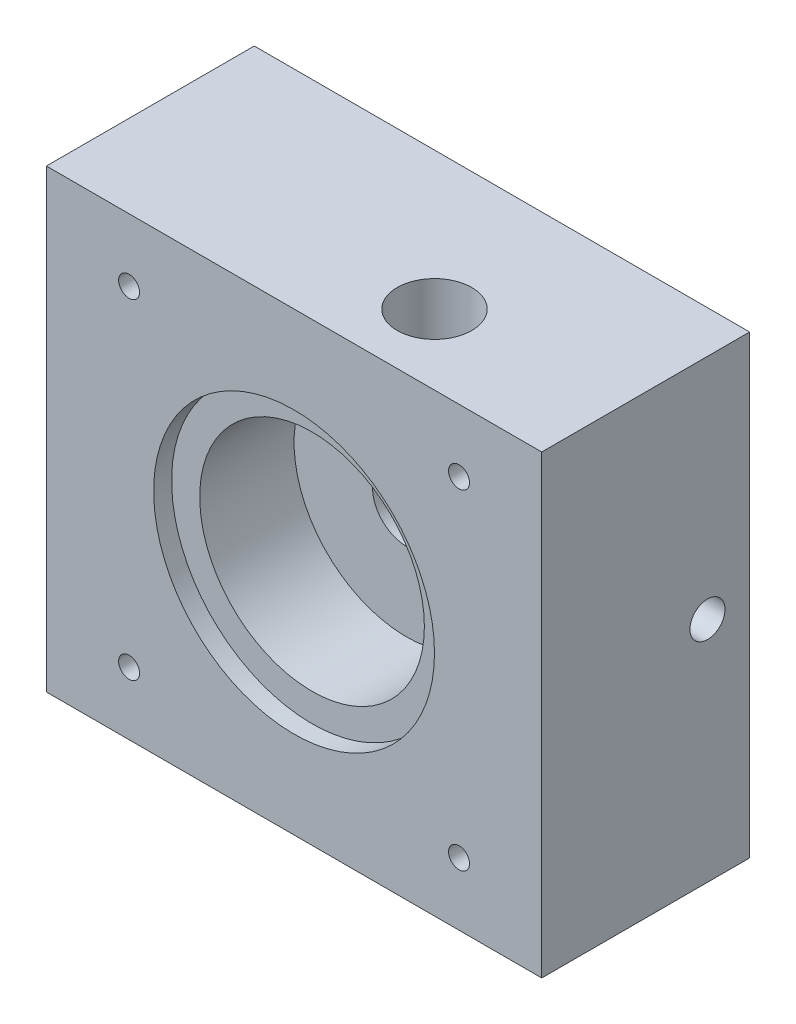
ISO-10303-21;
HEADER;
FILE_DESCRIPTION(('STEP AP214'),'2;1');
FILE_NAME('part.step','',(''),(''),'','','');
FILE_SCHEMA(('AUTOMOTIVE_DESIGN { 1 0 10303 214 1 1 1 1 }'));
ENDSEC;
DATA;
#1=APPLICATION_CONTEXT('core data for automotive mechanical design processes');
#2=APPLICATION_PROTOCOL_DEFINITION('international standard','automotive_design',2000,#1);
#3=PRODUCT_CONTEXT('',#1,'mechanical');
#4=PRODUCT('Part','Part','',(#3));
#5=PRODUCT_RELATED_PRODUCT_CATEGORY('part','',(#4));
#6=PRODUCT_DEFINITION_FORMATION('','',#4);
#7=PRODUCT_DEFINITION_CONTEXT('part definition',#1,'design');
#8=PRODUCT_DEFINITION('design','',#6,#7);
#9=PRODUCT_DEFINITION_SHAPE('','',#8);
#10=(LENGTH_UNIT() NAMED_UNIT(*) SI_UNIT(.MILLI.,.METRE.));
#11=(NAMED_UNIT(*) PLANE_ANGLE_UNIT() SI_UNIT($,.RADIAN.));
#12=(NAMED_UNIT(*) SI_UNIT($,.STERADIAN.) SOLID_ANGLE_UNIT());
#13=UNCERTAINTY_MEASURE_WITH_UNIT(LENGTH_MEASURE(1.E-05),#10,'distance_accuracy_value','');
#14=(GEOMETRIC_REPRESENTATION_CONTEXT(3) GLOBAL_UNCERTAINTY_ASSIGNED_CONTEXT((#13)) GLOBAL_UNIT_ASSIGNED_CONTEXT((#10,
#11,#12)) REPRESENTATION_CONTEXT('',''));
#15=CARTESIAN_POINT('',(0.,0.,0.));
#16=DIRECTION('',(0.,0.,1.));
#17=DIRECTION('',(1.,0.,0.));
#18=AXIS2_PLACEMENT_3D('',#15,#16,#17);
#19=CARTESIAN_POINT('',(-18.475,0.,6.35));
#20=DIRECTION('',(0.,0.,-1.));
#21=DIRECTION('',(-1.,0.,0.));
#22=AXIS2_PLACEMENT_3D('',#19,#20,#21);
#23=CYLINDRICAL_SURFACE('',#22,1.984375);
#24=CARTESIAN_POINT('',(-18.475,0.,0.));
#25=DIRECTION('',(0.,0.,1.));
#26=DIRECTION('',(1.,0.,0.));
#27=AXIS2_PLACEMENT_3D('',#24,#25,#26);
#28=CIRCLE('',#27,1.984375);
#29=CARTESIAN_POINT('',(-16.490625,0.,0.));
#30=VERTEX_POINT('',#29);
#31=EDGE_CURVE('E193',#30,#30,#28,.T.);
#32=ORIENTED_EDGE('',*,*,#31,.F.);
#33=EDGE_LOOP('',(#32));
#34=FACE_BOUND('',#33,.T.);
#35=DIRECTION('',(0.,0.,-1.));
#36=VECTOR('',#35,1.);
#37=CARTESIAN_POINT('',(-16.8875,1.190625,6.35));
#38=LINE('',#37,#36);
#39=CARTESIAN_POINT('',(-16.8875,1.190625,6.35));
#40=VERTEX_POINT('',#39);
#41=CARTESIAN_POINT('',(-16.8875,1.190625,3.175));
#42=VERTEX_POINT('',#41);
#43=EDGE_CURVE('E68',#40,#42,#38,.T.);
#44=ORIENTED_EDGE('',*,*,#43,.T.);
#45=CARTESIAN_POINT('',(-18.475,0.,4.7625));
#46=DIRECTION('',(-0.707106781186547,0.,-0.707106781186547));
#47=DIRECTION('',(0.707106781186547,0.,-0.707106781186547));
#48=AXIS2_PLACEMENT_3D('',#45,#46,#47);
#49=ELLIPSE('',#48,2.80633003783411,1.984375);
#50=CARTESIAN_POINT('',(-18.475,1.984375,4.7625));
#51=VERTEX_POINT('',#50);
#52=EDGE_CURVE('E136',#42,#51,#49,.F.);
#53=ORIENTED_EDGE('',*,*,#52,.T.);
#54=CARTESIAN_POINT('',(-18.475,0.,4.7625));
#55=DIRECTION('',(0.707106781186547,0.,-0.707106781186547));
#56=DIRECTION('',(-0.707106781186547,0.,-0.707106781186547));
#57=AXIS2_PLACEMENT_3D('',#54,#55,#56);
#58=ELLIPSE('',#57,2.80633003783411,1.984375);
#59=CARTESIAN_POINT('',(-18.475,-1.984375,4.7625));
#60=VERTEX_POINT('',#59);
#61=EDGE_CURVE('E164',#51,#60,#58,.F.);
#62=ORIENTED_EDGE('',*,*,#61,.T.);
#63=CARTESIAN_POINT('',(-16.8875,-1.190625,3.175));
#64=VERTEX_POINT('',#63);
#65=EDGE_CURVE('E148',#60,#64,#49,.F.);
#66=ORIENTED_EDGE('',*,*,#65,.T.);
#67=DIRECTION('',(0.,0.,-1.));
#68=VECTOR('',#67,1.);
#69=CARTESIAN_POINT('',(-16.8875,-1.190625,6.35));
#70=LINE('',#69,#68);
#71=CARTESIAN_POINT('',(-16.8875,-1.190625,6.35));
#72=VERTEX_POINT('',#71);
#73=EDGE_CURVE('E150',#64,#72,#70,.F.);
#74=ORIENTED_EDGE('',*,*,#73,.T.);
#75=CARTESIAN_POINT('',(-18.475,0.,6.35));
#76=DIRECTION('',(0.,0.,1.));
#77=DIRECTION('',(1.,0.,0.));
#78=AXIS2_PLACEMENT_3D('',#75,#76,#77);
#79=CIRCLE('',#78,1.984375);
#80=EDGE_CURVE('E156',#72,#40,#79,.T.);
#81=ORIENTED_EDGE('',*,*,#80,.T.);
#82=EDGE_LOOP('',(#44,#53,#62,#66,#74,#81));
#83=FACE_BOUND('',#82,.T.);
#84=ADVANCED_FACE('F46',(#34,#83),#23,.F.);
#85=CARTESIAN_POINT('',(-18.475,0.,6.35));
#86=DIRECTION('',(0.,0.,-1.));
#87=DIRECTION('',(1.,0.,0.));
#88=AXIS2_PLACEMENT_3D('',#85,#86,#87);
#89=PLANE('',#88);
#90=ORIENTED_EDGE('',*,*,#80,.F.);
#91=DIRECTION('',(0.,1.,0.));
#92=VECTOR('',#91,1.);
#93=CARTESIAN_POINT('',(-16.8875,0.,6.35));
#94=LINE('',#93,#92);
#95=EDGE_CURVE('E341',#72,#40,#94,.T.);
#96=ORIENTED_EDGE('',*,*,#95,.T.);
#97=EDGE_LOOP('',(#90,#96));
#98=FACE_BOUND('',#97,.T.);
#99=ADVANCED_FACE('F311',(#98),#89,.T.);
#100=CARTESIAN_POINT('',(18.475,0.,6.35));
#101=DIRECTION('',(0.,0.,-1.));
#102=DIRECTION('',(-1.,0.,0.));
#103=AXIS2_PLACEMENT_3D('',#100,#101,#102);
#104=CYLINDRICAL_SURFACE('',#103,1.984375);
#105=CARTESIAN_POINT('',(18.475,0.,0.));
#106=DIRECTION('',(0.,0.,-1.));
#107=DIRECTION('',(-1.,0.,0.));
#108=AXIS2_PLACEMENT_3D('',#105,#106,#107);
#109=CIRCLE('',#108,1.984375);
#110=CARTESIAN_POINT('',(16.490625,0.,0.));
#111=VERTEX_POINT('',#110);
#112=EDGE_CURVE('E197',#111,#111,#109,.T.);
#113=ORIENTED_EDGE('',*,*,#112,.T.);
#114=EDGE_LOOP('',(#113));
#115=FACE_BOUND('',#114,.T.);
#116=DIRECTION('',(0.,0.,-1.));
#117=VECTOR('',#116,1.);
#118=CARTESIAN_POINT('',(16.8875,-1.190625,6.35));
#119=LINE('',#118,#117);
#120=CARTESIAN_POINT('',(16.8875,-1.190625,3.175));
#121=VERTEX_POINT('',#120);
#122=CARTESIAN_POINT('',(16.8875,-1.190625,6.35));
#123=VERTEX_POINT('',#122);
#124=EDGE_CURVE('E176',#121,#123,#119,.F.);
#125=ORIENTED_EDGE('',*,*,#124,.F.);
#126=CARTESIAN_POINT('',(18.475,0.,4.7625));
#127=DIRECTION('',(0.707106781186547,0.,-0.707106781186547));
#128=DIRECTION('',(-0.707106781186547,0.,-0.707106781186547));
#129=AXIS2_PLACEMENT_3D('',#126,#127,#128);
#130=ELLIPSE('',#129,2.80633003783411,1.984375);
#131=CARTESIAN_POINT('',(18.475,-1.984375,4.7625));
#132=VERTEX_POINT('',#131);
#133=EDGE_CURVE('E185',#121,#132,#130,.F.);
#134=ORIENTED_EDGE('',*,*,#133,.T.);
#135=CARTESIAN_POINT('',(18.475,0.,4.7625));
#136=DIRECTION('',(-0.707106781186547,0.,-0.707106781186547));
#137=DIRECTION('',(0.707106781186547,0.,-0.707106781186547));
#138=AXIS2_PLACEMENT_3D('',#135,#136,#137);
#139=ELLIPSE('',#138,2.80633003783411,1.984375);
#140=CARTESIAN_POINT('',(18.475,1.984375,4.7625));
#141=VERTEX_POINT('',#140);
#142=EDGE_CURVE('E190',#132,#141,#139,.F.);
#143=ORIENTED_EDGE('',*,*,#142,.T.);
#144=CARTESIAN_POINT('',(16.8875,1.190625,3.175));
#145=VERTEX_POINT('',#144);
#146=EDGE_CURVE('E189',#141,#145,#130,.F.);
#147=ORIENTED_EDGE('',*,*,#146,.T.);
#148=DIRECTION('',(0.,0.,-1.));
#149=VECTOR('',#148,1.);
#150=CARTESIAN_POINT('',(16.8875,1.190625,6.35));
#151=LINE('',#150,#149);
#152=CARTESIAN_POINT('',(16.8875,1.190625,6.35));
#153=VERTEX_POINT('',#152);
#154=EDGE_CURVE('E170',#153,#145,#151,.T.);
#155=ORIENTED_EDGE('',*,*,#154,.F.);
#156=CARTESIAN_POINT('',(18.475,0.,6.35));
#157=DIRECTION('',(0.,0.,-1.));
#158=DIRECTION('',(-1.,0.,0.));
#159=AXIS2_PLACEMENT_3D('',#156,#157,#158);
#160=CIRCLE('',#159,1.984375);
#161=EDGE_CURVE('E206',#123,#153,#160,.T.);
#162=ORIENTED_EDGE('',*,*,#161,.F.);
#163=EDGE_LOOP('',(#125,#134,#143,#147,#155,#162));
#164=FACE_BOUND('',#163,.T.);
#165=ADVANCED_FACE('F319',(#115,#164),#104,.F.);
#166=CARTESIAN_POINT('',(18.475,0.,6.35));
#167=DIRECTION('',(0.,0.,-1.));
#168=DIRECTION('',(-1.,0.,0.));
#169=AXIS2_PLACEMENT_3D('',#166,#167,#168);
#170=PLANE('',#169);
#171=ORIENTED_EDGE('',*,*,#161,.T.);
#172=DIRECTION('',(0.,-1.,0.));
#173=VECTOR('',#172,1.);
#174=CARTESIAN_POINT('',(16.8875,0.,6.35));
#175=LINE('',#174,#173);
#176=EDGE_CURVE('E264',#153,#123,#175,.T.);
#177=ORIENTED_EDGE('',*,*,#176,.T.);
#178=EDGE_LOOP('',(#171,#177));
#179=FACE_BOUND('',#178,.T.);
#180=ADVANCED_FACE('F299',(#179),#170,.T.);
#181=CARTESIAN_POINT('',(0.,0.,0.));
#182=DIRECTION('',(0.,0.,1.));
#183=DIRECTION('',(1.,0.,0.));
#184=AXIS2_PLACEMENT_3D('',#181,#182,#183);
#185=CYLINDRICAL_SURFACE('',#184,3.8354);
#186=CARTESIAN_POINT('',(0.,0.,10.8));
#187=DIRECTION('',(0.,0.,1.));
#188=DIRECTION('',(1.,0.,0.));
#189=AXIS2_PLACEMENT_3D('',#186,#187,#188);
#190=CIRCLE('',#189,3.8354);
#191=CARTESIAN_POINT('',(3.8354,0.,10.8));
#192=VERTEX_POINT('',#191);
#193=EDGE_CURVE('E219',#192,#192,#190,.T.);
#194=ORIENTED_EDGE('',*,*,#193,.T.);
#195=EDGE_LOOP('',(#194));
#196=FACE_BOUND('',#195,.T.);
#197=CARTESIAN_POINT('',(0.,0.,2.794));
#198=DIRECTION('',(0.,0.,-1.));
#199=DIRECTION('',(-1.,0.,0.));
#200=AXIS2_PLACEMENT_3D('',#197,#198,#199);
#201=CIRCLE('',#200,3.8354);
#202=CARTESIAN_POINT('',(-3.8354,0.,2.794));
#203=VERTEX_POINT('',#202);
#204=EDGE_CURVE('E215',#203,#203,#201,.F.);
#205=ORIENTED_EDGE('',*,*,#204,.F.);
#206=EDGE_LOOP('',(#205));
#207=FACE_BOUND('',#206,.T.);
#208=ADVANCED_FACE('F297',(#196,#207),#185,.F.);
#209=CARTESIAN_POINT('',(28.,-25.75,23.5));
#210=DIRECTION('',(-1.,0.,0.));
#211=DIRECTION('',(0.,0.,1.));
#212=AXIS2_PLACEMENT_3D('',#209,#210,#211);
#213=PLANE('',#212);
#214=CARTESIAN_POINT('',(28.,0.,4.7625));
#215=DIRECTION('',(1.,0.,0.));
#216=DIRECTION('',(0.,0.,-1.));
#217=AXIS2_PLACEMENT_3D('',#214,#215,#216);
#218=CIRCLE('',#217,1.984375);
#219=CARTESIAN_POINT('',(28.,0.,2.778125));
#220=VERTEX_POINT('',#219);
#221=EDGE_CURVE('E166',#220,#220,#218,.T.);
#222=ORIENTED_EDGE('',*,*,#221,.F.);
#223=EDGE_LOOP('',(#222));
#224=FACE_BOUND('',#223,.T.);
#225=DIRECTION('',(0.,1.,0.));
#226=VECTOR('',#225,1.);
#227=CARTESIAN_POINT('',(28.,-25.75,0.));
#228=LINE('',#227,#226);
#229=CARTESIAN_POINT('',(28.,-25.75,0.));
#230=VERTEX_POINT('',#229);
#231=CARTESIAN_POINT('',(28.,25.75,0.));
#232=VERTEX_POINT('',#231);
#233=EDGE_CURVE('E232',#230,#232,#228,.T.);
#234=ORIENTED_EDGE('',*,*,#233,.T.);
#235=DIRECTION('',(0.,0.,-1.));
#236=VECTOR('',#235,1.);
#237=CARTESIAN_POINT('',(28.,25.75,23.5));
#238=LINE('',#237,#236);
#239=CARTESIAN_POINT('',(28.,25.75,23.5));
#240=VERTEX_POINT('',#239);
#241=EDGE_CURVE('E261',#240,#232,#238,.T.);
#242=ORIENTED_EDGE('',*,*,#241,.F.);
#243=DIRECTION('',(0.,1.,0.));
#244=VECTOR('',#243,1.);
#245=CARTESIAN_POINT('',(28.,-25.75,23.5));
#246=LINE('',#245,#244);
#247=CARTESIAN_POINT('',(28.,-25.75,23.5));
#248=VERTEX_POINT('',#247);
#249=EDGE_CURVE('E235',#248,#240,#246,.T.);
#250=ORIENTED_EDGE('',*,*,#249,.F.);
#251=DIRECTION('',(0.,0.,-1.));
#252=VECTOR('',#251,1.);
#253=CARTESIAN_POINT('',(28.,-25.75,23.5));
#254=LINE('',#253,#252);
#255=EDGE_CURVE('E245',#248,#230,#254,.T.);
#256=ORIENTED_EDGE('',*,*,#255,.T.);
#257=EDGE_LOOP('',(#234,#242,#250,#256));
#258=FACE_BOUND('',#257,.T.);
#259=ADVANCED_FACE('F48',(#224,#258),#213,.F.);
#260=CARTESIAN_POINT('',(28.,25.75,23.5));
#261=DIRECTION('',(0.,-1.,0.));
#262=DIRECTION('',(0.,0.,-1.));
#263=AXIS2_PLACEMENT_3D('',#260,#261,#262);
#264=PLANE('',#263);
#265=CARTESIAN_POINT('',(7.9375,25.75,15.5625));
#266=DIRECTION('',(0.,1.,0.));
#267=DIRECTION('',(0.,0.,1.));
#268=AXIS2_PLACEMENT_3D('',#265,#266,#267);
#269=CIRCLE('',#268,4.2164);
#270=CARTESIAN_POINT('',(7.9375,25.75,19.7789));
#271=VERTEX_POINT('',#270);
#272=EDGE_CURVE('E204',#271,#271,#269,.T.);
#273=ORIENTED_EDGE('',*,*,#272,.F.);
#274=EDGE_LOOP('',(#273));
#275=FACE_BOUND('',#274,.T.);
#276=DIRECTION('',(-1.,0.,0.));
#277=VECTOR('',#276,1.);
#278=CARTESIAN_POINT('',(28.,25.75,0.));
#279=LINE('',#278,#277);
#280=CARTESIAN_POINT('',(-28.,25.75,0.));
#281=VERTEX_POINT('',#280);
#282=EDGE_CURVE('E248',#232,#281,#279,.T.);
#283=ORIENTED_EDGE('',*,*,#282,.T.);
#284=DIRECTION('',(0.,0.,-1.));
#285=VECTOR('',#284,1.);
#286=CARTESIAN_POINT('',(-28.,25.75,23.5));
#287=LINE('',#286,#285);
#288=CARTESIAN_POINT('',(-28.,25.75,23.5));
#289=VERTEX_POINT('',#288);
#290=EDGE_CURVE('E258',#289,#281,#287,.T.);
#291=ORIENTED_EDGE('',*,*,#290,.F.);
#292=DIRECTION('',(-1.,0.,0.));
#293=VECTOR('',#292,1.);
#294=CARTESIAN_POINT('',(28.,25.75,23.5));
#295=LINE('',#294,#293);
#296=EDGE_CURVE('E238',#240,#289,#295,.T.);
#297=ORIENTED_EDGE('',*,*,#296,.F.);
#298=ORIENTED_EDGE('',*,*,#241,.T.);
#299=EDGE_LOOP('',(#283,#291,#297,#298));
#300=FACE_BOUND('',#299,.T.);
#301=ADVANCED_FACE('F421',(#275,#300),#264,.F.);
#302=CARTESIAN_POINT('',(-28.,25.75,23.5));
#303=DIRECTION('',(1.,0.,0.));
#304=DIRECTION('',(0.,0.,-1.));
#305=AXIS2_PLACEMENT_3D('',#302,#303,#304);
#306=PLANE('',#305);
#307=CARTESIAN_POINT('',(-28.,0.,4.7625));
#308=DIRECTION('',(1.,0.,0.));
#309=DIRECTION('',(0.,0.,-1.));
#310=AXIS2_PLACEMENT_3D('',#307,#308,#309);
#311=CIRCLE('',#310,1.984375);
#312=CARTESIAN_POINT('',(-28.,0.,2.778125));
#313=VERTEX_POINT('',#312);
#314=EDGE_CURVE('E725',#313,#313,#311,.T.);
#315=ORIENTED_EDGE('',*,*,#314,.T.);
#316=EDGE_LOOP('',(#315));
#317=FACE_BOUND('',#316,.T.);
#318=DIRECTION('',(0.,-1.,0.));
#319=VECTOR('',#318,1.);
#320=CARTESIAN_POINT('',(-28.,25.75,0.));
#321=LINE('',#320,#319);
#322=CARTESIAN_POINT('',(-28.,-25.75,0.));
#323=VERTEX_POINT('',#322);
#324=EDGE_CURVE('E250',#281,#323,#321,.T.);
#325=ORIENTED_EDGE('',*,*,#324,.T.);
#326=DIRECTION('',(0.,0.,-1.));
#327=VECTOR('',#326,1.);
#328=CARTESIAN_POINT('',(-28.,-25.75,23.5));
#329=LINE('',#328,#327);
#330=CARTESIAN_POINT('',(-28.,-25.75,23.5));
#331=VERTEX_POINT('',#330);
#332=EDGE_CURVE('E255',#331,#323,#329,.T.);
#333=ORIENTED_EDGE('',*,*,#332,.F.);
#334=DIRECTION('',(0.,-1.,0.));
#335=VECTOR('',#334,1.);
#336=CARTESIAN_POINT('',(-28.,25.75,23.5));
#337=LINE('',#336,#335);
#338=EDGE_CURVE('E241',#289,#331,#337,.T.);
#339=ORIENTED_EDGE('',*,*,#338,.F.);
#340=ORIENTED_EDGE('',*,*,#290,.T.);
#341=EDGE_LOOP('',(#325,#333,#339,#340));
#342=FACE_BOUND('',#341,.T.);
#343=ADVANCED_FACE('F440',(#317,#342),#306,.F.);
#344=CARTESIAN_POINT('',(-28.,-25.75,23.5));
#345=DIRECTION('',(0.,1.,0.));
#346=DIRECTION('',(0.,0.,1.));
#347=AXIS2_PLACEMENT_3D('',#344,#345,#346);
#348=PLANE('',#347);
#349=DIRECTION('',(1.,0.,0.));
#350=VECTOR('',#349,1.);
#351=CARTESIAN_POINT('',(-28.,-25.75,0.));
#352=LINE('',#351,#350);
#353=EDGE_CURVE('E239',#323,#230,#352,.T.);
#354=ORIENTED_EDGE('',*,*,#353,.T.);
#355=ORIENTED_EDGE('',*,*,#255,.F.);
#356=DIRECTION('',(1.,0.,0.));
#357=VECTOR('',#356,1.);
#358=CARTESIAN_POINT('',(-28.,-25.75,23.5));
#359=LINE('',#358,#357);
#360=EDGE_CURVE('E243',#331,#248,#359,.T.);
#361=ORIENTED_EDGE('',*,*,#360,.F.);
#362=ORIENTED_EDGE('',*,*,#332,.T.);
#363=EDGE_LOOP('',(#354,#355,#361,#362));
#364=FACE_BOUND('',#363,.T.);
#365=ADVANCED_FACE('F438',(#364),#348,.F.);
#366=CARTESIAN_POINT('',(0.,0.,23.5));
#367=DIRECTION('',(0.,0.,1.));
#368=DIRECTION('',(1.,0.,0.));
#369=AXIS2_PLACEMENT_3D('',#366,#367,#368);
#370=PLANE('',#369);
#371=CARTESIAN_POINT('',(-18.65,18.65,23.5));
#372=DIRECTION('',(0.,0.,-1.));
#373=DIRECTION('',(-1.,0.,0.));
#374=AXIS2_PLACEMENT_3D('',#371,#372,#373);
#375=CIRCLE('',#374,1.1811);
#376=CARTESIAN_POINT('',(-19.8311,18.65,23.5));
#377=VERTEX_POINT('',#376);
#378=EDGE_CURVE('E705',#377,#377,#375,.T.);
#379=ORIENTED_EDGE('',*,*,#378,.T.);
#380=EDGE_LOOP('',(#379));
#381=FACE_BOUND('',#380,.T.);
#382=CARTESIAN_POINT('',(-18.65,-18.65,23.5));
#383=DIRECTION('',(0.,0.,1.));
#384=DIRECTION('',(-1.,0.,0.));
#385=AXIS2_PLACEMENT_3D('',#382,#383,#384);
#386=CIRCLE('',#385,1.1811);
#387=CARTESIAN_POINT('',(-19.8311,-18.65,23.5));
#388=VERTEX_POINT('',#387);
#389=EDGE_CURVE('E707',#388,#388,#386,.T.);
#390=ORIENTED_EDGE('',*,*,#389,.F.);
#391=EDGE_LOOP('',(#390));
#392=FACE_BOUND('',#391,.T.);
#393=CARTESIAN_POINT('',(18.65,-18.65,23.5));
#394=DIRECTION('',(0.,0.,-1.));
#395=DIRECTION('',(1.,0.,0.));
#396=AXIS2_PLACEMENT_3D('',#393,#394,#395);
#397=CIRCLE('',#396,1.1811);
#398=CARTESIAN_POINT('',(19.8311,-18.65,23.5));
#399=VERTEX_POINT('',#398);
#400=EDGE_CURVE('E713',#399,#399,#397,.T.);
#401=ORIENTED_EDGE('',*,*,#400,.T.);
#402=EDGE_LOOP('',(#401));
#403=FACE_BOUND('',#402,.T.);
#404=CARTESIAN_POINT('',(18.65,18.65,23.5));
#405=DIRECTION('',(0.,0.,1.));
#406=DIRECTION('',(1.,0.,0.));
#407=AXIS2_PLACEMENT_3D('',#404,#405,#406);
#408=CIRCLE('',#407,1.1811);
#409=CARTESIAN_POINT('',(19.8311,18.65,23.5));
#410=VERTEX_POINT('',#409);
#411=EDGE_CURVE('E719',#410,#410,#408,.T.);
#412=ORIENTED_EDGE('',*,*,#411,.F.);
#413=EDGE_LOOP('',(#412));
#414=FACE_BOUND('',#413,.T.);
#415=CARTESIAN_POINT('',(0.,0.,23.5));
#416=DIRECTION('',(0.,0.,1.));
#417=DIRECTION('',(1.,0.,0.));
#418=AXIS2_PLACEMENT_3D('',#415,#416,#417);
#419=CIRCLE('',#418,15.875);
#420=CARTESIAN_POINT('',(15.875,0.,23.5));
#421=VERTEX_POINT('',#420);
#422=EDGE_CURVE('E226',#421,#421,#419,.T.);
#423=ORIENTED_EDGE('',*,*,#422,.F.);
#424=EDGE_LOOP('',(#423));
#425=FACE_BOUND('',#424,.T.);
#426=ORIENTED_EDGE('',*,*,#249,.T.);
#427=ORIENTED_EDGE('',*,*,#296,.T.);
#428=ORIENTED_EDGE('',*,*,#338,.T.);
#429=ORIENTED_EDGE('',*,*,#360,.T.);
#430=EDGE_LOOP('',(#426,#427,#428,#429));
#431=FACE_BOUND('',#430,.T.);
#432=ADVANCED_FACE('F434',(#381,#392,#403,#414,#425,#431),#370,.T.);
#433=CARTESIAN_POINT('',(0.,0.,0.));
#434=DIRECTION('',(0.,0.,1.));
#435=DIRECTION('',(1.,0.,0.));
#436=AXIS2_PLACEMENT_3D('',#433,#434,#435);
#437=PLANE('',#436);
#438=CARTESIAN_POINT('',(-18.65,18.65,0.));
#439=DIRECTION('',(0.,0.,-1.));
#440=DIRECTION('',(-1.,0.,0.));
#441=AXIS2_PLACEMENT_3D('',#438,#439,#440);
#442=CIRCLE('',#441,1.1811);
#443=CARTESIAN_POINT('',(-19.8311,18.65,0.));
#444=VERTEX_POINT('',#443);
#445=EDGE_CURVE('E702',#444,#444,#442,.T.);
#446=ORIENTED_EDGE('',*,*,#445,.F.);
#447=EDGE_LOOP('',(#446));
#448=FACE_BOUND('',#447,.T.);
#449=CARTESIAN_POINT('',(-18.65,-18.65,0.));
#450=DIRECTION('',(0.,0.,1.));
#451=DIRECTION('',(-1.,0.,0.));
#452=AXIS2_PLACEMENT_3D('',#449,#450,#451);
#453=CIRCLE('',#452,1.1811);
#454=CARTESIAN_POINT('',(-19.8311,-18.65,0.));
#455=VERTEX_POINT('',#454);
#456=EDGE_CURVE('E710',#455,#455,#453,.T.);
#457=ORIENTED_EDGE('',*,*,#456,.T.);
#458=EDGE_LOOP('',(#457));
#459=FACE_BOUND('',#458,.T.);
#460=CARTESIAN_POINT('',(18.65,-18.65,0.));
#461=DIRECTION('',(0.,0.,-1.));
#462=DIRECTION('',(1.,0.,0.));
#463=AXIS2_PLACEMENT_3D('',#460,#461,#462);
#464=CIRCLE('',#463,1.1811);
#465=CARTESIAN_POINT('',(19.8311,-18.65,0.));
#466=VERTEX_POINT('',#465);
#467=EDGE_CURVE('E716',#466,#466,#464,.T.);
#468=ORIENTED_EDGE('',*,*,#467,.F.);
#469=EDGE_LOOP('',(#468));
#470=FACE_BOUND('',#469,.T.);
#471=CARTESIAN_POINT('',(18.65,18.65,0.));
#472=DIRECTION('',(0.,0.,1.));
#473=DIRECTION('',(1.,0.,0.));
#474=AXIS2_PLACEMENT_3D('',#471,#472,#473);
#475=CIRCLE('',#474,1.1811);
#476=CARTESIAN_POINT('',(19.8311,18.65,0.));
#477=VERTEX_POINT('',#476);
#478=EDGE_CURVE('E722',#477,#477,#475,.T.);
#479=ORIENTED_EDGE('',*,*,#478,.T.);
#480=EDGE_LOOP('',(#479));
#481=FACE_BOUND('',#480,.T.);
#482=ORIENTED_EDGE('',*,*,#31,.T.);
#483=EDGE_LOOP('',(#482));
#484=FACE_BOUND('',#483,.T.);
#485=ORIENTED_EDGE('',*,*,#112,.F.);
#486=EDGE_LOOP('',(#485));
#487=FACE_BOUND('',#486,.T.);
#488=CARTESIAN_POINT('',(0.,0.,0.));
#489=DIRECTION('',(0.,0.,-1.));
#490=DIRECTION('',(-1.,0.,0.));
#491=AXIS2_PLACEMENT_3D('',#488,#489,#490);
#492=CIRCLE('',#491,6.35);
#493=CARTESIAN_POINT('',(-6.35,0.,0.));
#494=VERTEX_POINT('',#493);
#495=EDGE_CURVE('E216',#494,#494,#492,.T.);
#496=ORIENTED_EDGE('',*,*,#495,.F.);
#497=EDGE_LOOP('',(#496));
#498=FACE_BOUND('',#497,.T.);
#499=ORIENTED_EDGE('',*,*,#233,.F.);
#500=ORIENTED_EDGE('',*,*,#353,.F.);
#501=ORIENTED_EDGE('',*,*,#324,.F.);
#502=ORIENTED_EDGE('',*,*,#282,.F.);
#503=EDGE_LOOP('',(#499,#500,#501,#502));
#504=FACE_BOUND('',#503,.T.);
#505=ADVANCED_FACE('F428',(#448,#459,#470,#481,#484,#487,#498,#504),#437,.F.);
#506=CARTESIAN_POINT('',(0.,0.,21.468));
#507=DIRECTION('',(0.,0.,1.));
#508=DIRECTION('',(1.,0.,0.));
#509=AXIS2_PLACEMENT_3D('',#506,#507,#508);
#510=CYLINDRICAL_SURFACE('',#509,15.875);
#511=CARTESIAN_POINT('',(0.,0.,21.468));
#512=DIRECTION('',(0.,0.,1.));
#513=DIRECTION('',(1.,0.,0.));
#514=AXIS2_PLACEMENT_3D('',#511,#512,#513);
#515=CIRCLE('',#514,15.875);
#516=CARTESIAN_POINT('',(15.875,0.,21.468));
#517=VERTEX_POINT('',#516);
#518=EDGE_CURVE('E229',#517,#517,#515,.T.);
#519=ORIENTED_EDGE('',*,*,#518,.F.);
#520=EDGE_LOOP('',(#519));
#521=FACE_BOUND('',#520,.T.);
#522=ORIENTED_EDGE('',*,*,#422,.T.);
#523=EDGE_LOOP('',(#522));
#524=FACE_BOUND('',#523,.T.);
#525=ADVANCED_FACE('F454',(#521,#524),#510,.F.);
#526=CARTESIAN_POINT('',(0.,0.,21.468));
#527=DIRECTION('',(0.,0.,1.));
#528=DIRECTION('',(1.,0.,0.));
#529=AXIS2_PLACEMENT_3D('',#526,#527,#528);
#530=PLANE('',#529);
#531=CARTESIAN_POINT('',(0.,0.,21.468));
#532=DIRECTION('',(0.,0.,1.));
#533=DIRECTION('',(1.,0.,0.));
#534=AXIS2_PLACEMENT_3D('',#531,#532,#533);
#535=CIRCLE('',#534,12.7);
#536=CARTESIAN_POINT('',(12.7,0.,21.468));
#537=VERTEX_POINT('',#536);
#538=EDGE_CURVE('E222',#537,#537,#535,.T.);
#539=ORIENTED_EDGE('',*,*,#538,.F.);
#540=EDGE_LOOP('',(#539));
#541=FACE_BOUND('',#540,.T.);
#542=ORIENTED_EDGE('',*,*,#518,.T.);
#543=EDGE_LOOP('',(#542));
#544=FACE_BOUND('',#543,.T.);
#545=ADVANCED_FACE('F306',(#541,#544),#530,.T.);
#546=CARTESIAN_POINT('',(0.,0.,10.8));
#547=DIRECTION('',(0.,0.,1.));
#548=DIRECTION('',(1.,0.,0.));
#549=AXIS2_PLACEMENT_3D('',#546,#547,#548);
#550=CYLINDRICAL_SURFACE('',#549,12.7);
#551=CARTESIAN_POINT('',(7.9375,9.91393432245746,19.7789));
#552=CARTESIAN_POINT('',(8.07662802927976,9.80254174511982,19.778900216119));
#553=CARTESIAN_POINT('',(8.21343355757037,9.68819320893606,19.7720134166104));
#554=CARTESIAN_POINT('',(8.48148396184856,9.45442231421443,19.7458318174462));
#555=CARTESIAN_POINT('',(8.61272513638608,9.33499668092679,19.7265288923607));
#556=CARTESIAN_POINT('',(8.8694079135831,9.09147949707654,19.676710013297));
#557=CARTESIAN_POINT('',(8.99482881403015,8.96737377142128,19.6461570430975));
#558=CARTESIAN_POINT('',(9.23900135208694,8.71559649578408,19.5750171205012));
#559=CARTESIAN_POINT('',(9.35775347745681,8.58792520761594,19.5344309031211));
#560=CARTESIAN_POINT('',(9.64035538439622,8.27143178437908,19.4239224861815));
#561=CARTESIAN_POINT('',(9.80043219296431,8.08096227143771,19.3490200894582));
#562=CARTESIAN_POINT('',(10.1059579166009,7.69546422066408,19.1827342367703));
#563=CARTESIAN_POINT('',(10.251398865194,7.50043327040115,19.0913418799005));
#564=CARTESIAN_POINT('',(10.5277270122318,7.10737039039879,18.8938086455895));
#565=CARTESIAN_POINT('',(10.6586046235855,6.90933658018312,18.7876581550273));
#566=CARTESIAN_POINT('',(10.9058179090983,6.51212685995852,18.5616961942211));
#567=CARTESIAN_POINT('',(11.022159806597,6.31295147716928,18.4418906125893));
#568=CARTESIAN_POINT('',(11.1980564691428,5.99272679210001,18.2378003725987));
#569=CARTESIAN_POINT('',(11.2621130738036,5.87138799094202,18.1577987331947));
#570=CARTESIAN_POINT('',(11.3848564826955,5.62968891156643,17.9923922257172));
#571=CARTESIAN_POINT('',(11.4435440078874,5.50932850395351,17.906988085705));
#572=CARTESIAN_POINT('',(11.5553508240528,5.27078451249641,17.7304656057517));
#573=CARTESIAN_POINT('',(11.6084847233439,5.15259592809799,17.6393633190012));
#574=CARTESIAN_POINT('',(11.7092006357529,4.91942221731436,17.4502993997106));
#575=CARTESIAN_POINT('',(11.7567851429677,4.80443566964444,17.3523408805318));
#576=CARTESIAN_POINT('',(11.8406779709564,4.59343362600429,17.160263116512));
#577=CARTESIAN_POINT('',(11.8776540186308,4.49680640444158,17.0671140989876));
#578=CARTESIAN_POINT('',(11.946651364214,4.31014953650316,16.8722525918994));
#579=CARTESIAN_POINT('',(11.9786655016631,4.22012952164879,16.7705280477802));
#580=CARTESIAN_POINT('',(12.0323202066154,4.06435842963636,16.572156502899));
#581=CARTESIAN_POINT('',(12.0547962744492,3.99699170574955,16.4770295852183));
#582=CARTESIAN_POINT('',(12.094134820026,3.8763257115477,16.2771360268526));
#583=CARTESIAN_POINT('',(12.1110177857001,3.82297525077158,16.1724064035603));
#584=CARTESIAN_POINT('',(12.1323148043534,3.75469346051069,15.9941519854232));
#585=CARTESIAN_POINT('',(12.1390307234782,3.73285568891373,15.9236014195256));
#586=CARTESIAN_POINT('',(12.1489150314796,3.70056149161381,15.7797234373582));
#587=CARTESIAN_POINT('',(12.1520896818643,3.69008497837355,15.7064011600789));
#588=CARTESIAN_POINT('',(12.1545481156763,3.68198115313644,15.5585986243642));
#589=CARTESIAN_POINT('',(12.1538131492894,3.68441576036479,15.4841144969057));
#590=CARTESIAN_POINT('',(12.1485011020894,3.70189062387787,15.336763162896));
#591=CARTESIAN_POINT('',(12.1439192613793,3.71694649694204,15.2638980743548));
#592=CARTESIAN_POINT('',(12.1294393668785,3.76396899752335,15.0994015711825));
#593=CARTESIAN_POINT('',(12.1183300593205,3.79974192943523,15.0089929760712));
#594=CARTESIAN_POINT('',(12.0916038742856,3.88394851525073,14.834994732195));
#595=CARTESIAN_POINT('',(12.0759735749089,3.93241982704839,14.7514263525769));
#596=CARTESIAN_POINT('',(12.0414834328254,4.03678766559507,14.5919955379318));
#597=CARTESIAN_POINT('',(12.0226826478645,4.09254482784492,14.5160267218405));
#598=CARTESIAN_POINT('',(11.982226742838,4.20952269528598,14.3691766032985));
#599=CARTESIAN_POINT('',(11.9605686531712,4.27074906295602,14.2983007139618));
#600=CARTESIAN_POINT('',(11.9147076601234,4.39707540523644,14.1606732615415));
#601=CARTESIAN_POINT('',(11.8904987837041,4.4621843095194,14.0939319872286));
#602=CARTESIAN_POINT('',(11.8397837164516,4.59506099329637,13.9640413274219));
#603=CARTESIAN_POINT('',(11.8132766872333,4.66282973814581,13.9008932667947));
#604=CARTESIAN_POINT('',(11.7523545719437,4.81457811175462,13.7648429428732));
#605=CARTESIAN_POINT('',(11.7174426338467,4.8989929618861,13.6926503111251));
#606=CARTESIAN_POINT('',(11.6445999864085,5.06970628244863,13.5521037372213));
#607=CARTESIAN_POINT('',(11.6066685696884,5.15600519080452,13.4837507010098));
#608=CARTESIAN_POINT('',(11.4884016398084,5.41692237195013,13.2836378565293));
#609=CARTESIAN_POINT('',(11.4036422875604,5.59343809689647,13.1569312780891));
#610=CARTESIAN_POINT('',(11.2224563291192,5.94864411270691,12.9148733768859));
#611=CARTESIAN_POINT('',(11.1260119926957,6.12733732858221,12.7995398043099));
#612=CARTESIAN_POINT('',(10.9215526168681,6.48475586792931,12.5798912942664));
#613=CARTESIAN_POINT('',(10.8135423798795,6.66348114754902,12.4755718189636));
#614=CARTESIAN_POINT('',(10.5725872387882,7.04031620254087,12.2666488769533));
#615=CARTESIAN_POINT('',(10.4382032952772,7.23827034406018,12.1634154403965));
#616=CARTESIAN_POINT('',(10.1546309838938,7.63099918626338,11.972009782688));
#617=CARTESIAN_POINT('',(10.0054375198687,7.82577276543699,11.8838427746967));
#618=CARTESIAN_POINT('',(9.69272559965962,8.20988656527998,11.724805727572));
#619=CARTESIAN_POINT('',(9.52924874106679,8.39924056329484,11.6538875958792));
#620=CARTESIAN_POINT('',(9.18799074510355,8.77122670308837,11.5317301489407));
#621=CARTESIAN_POINT('',(9.01021939806567,8.95386332275673,11.4804775012966));
#622=CARTESIAN_POINT('',(8.70977870096203,9.24423199883176,11.4157312755011));
#623=CARTESIAN_POINT('',(8.59113574627781,9.35461487962196,11.395283550394));
#624=CARTESIAN_POINT('',(8.34898269451078,9.57135635639381,11.364452643209));
#625=CARTESIAN_POINT('',(8.22547398674787,9.67771608434787,11.3540666095796));
#626=CARTESIAN_POINT('',(7.97427885123906,9.8857194013399,11.3443889357973));
#627=CARTESIAN_POINT('',(7.84659601711163,9.98736687397525,11.3450879907907));
#628=CARTESIAN_POINT('',(7.58780162739141,10.1853713971942,11.3586303129242));
#629=CARTESIAN_POINT('',(7.45669059170197,10.2817292431838,11.3714717488814));
#630=CARTESIAN_POINT('',(7.21450774015187,10.4527029971413,11.4070627855703));
#631=CARTESIAN_POINT('',(7.10378811876306,10.5282438184363,11.4277745734162));
#632=CARTESIAN_POINT('',(6.8815950401767,10.6747997815189,11.478864030482));
#633=CARTESIAN_POINT('',(6.77012173818544,10.7458158254791,11.5092397655717));
#634=CARTESIAN_POINT('',(6.54736515877432,10.8829738482304,11.5801368878798));
#635=CARTESIAN_POINT('',(6.43608190725796,10.9491152074876,11.6206595618259));
#636=CARTESIAN_POINT('',(6.21490251724763,11.0761564842905,11.7121751796783));
#637=CARTESIAN_POINT('',(6.10500570921904,11.1370590214352,11.7631628470134));
#638=CARTESIAN_POINT('',(5.88698719795254,11.2538343721771,11.8762261186549));
#639=CARTESIAN_POINT('',(5.7788848954617,11.3096662007685,11.9383817299955));
#640=CARTESIAN_POINT('',(5.56673865568719,11.4155802498036,12.0734709475546));
#641=CARTESIAN_POINT('',(5.4626928575534,11.465665127546,12.1463995365473));
#642=CARTESIAN_POINT('',(5.26004408524963,11.5600360008625,12.302800793777));
#643=CARTESIAN_POINT('',(5.16144061697617,11.6043225233659,12.3862725025448));
#644=CARTESIAN_POINT('',(4.97108955552239,11.6871315382786,12.5632796495822));
#645=CARTESIAN_POINT('',(4.8793410924514,11.7256547626665,12.656813807253));
#646=CARTESIAN_POINT('',(4.7145949633975,11.7927745802661,12.8414108566706));
#647=CARTESIAN_POINT('',(4.64066941066896,11.822007843968,12.9314171531215));
#648=CARTESIAN_POINT('',(4.49999991581323,11.8762656009115,13.118062556281));
#649=CARTESIAN_POINT('',(4.43325541774873,11.9012904200438,13.2147011485855));
#650=CARTESIAN_POINT('',(4.30771369691842,11.9473040654859,13.4138870411853));
#651=CARTESIAN_POINT('',(4.24891472630293,11.968293779865,13.5164330348734));
#652=CARTESIAN_POINT('',(4.13989784955206,12.0064392440577,13.7266713340457));
#653=CARTESIAN_POINT('',(4.08967981841659,12.0235950497216,13.8343635645344));
#654=CARTESIAN_POINT('',(4.00067137235041,12.0534941315024,14.0485083622553));
#655=CARTESIAN_POINT('',(3.96143267542826,12.0664161750814,14.1547500161549));
#656=CARTESIAN_POINT('',(3.89154547680097,12.0891366884586,14.3703881962007));
#657=CARTESIAN_POINT('',(3.86089983066879,12.0989341200594,14.4797857578045));
#658=CARTESIAN_POINT('',(3.80851523794022,12.1155258692787,14.7008655657064));
#659=CARTESIAN_POINT('',(3.78677247141652,12.122321474979,14.8125468105109));
#660=CARTESIAN_POINT('',(3.7523678633033,12.1330153195431,15.0374788829045));
#661=CARTESIAN_POINT('',(3.73970937884453,12.1369124872975,15.1507302750042));
#662=CARTESIAN_POINT('',(3.72364881039766,12.1418495186437,15.3772786587905));
#663=CARTESIAN_POINT('',(3.72019270720279,12.1429060574654,15.4905714623304));
#664=CARTESIAN_POINT('',(3.72241254983343,12.1422257517196,15.7171010268996));
#665=CARTESIAN_POINT('',(3.72809184840608,12.1404878815873,15.8303377520893));
#666=CARTESIAN_POINT('',(3.7485343038471,12.1341915485419,16.0558669216257));
#667=CARTESIAN_POINT('',(3.76329409855598,12.129634129596,16.1681596998878));
#668=CARTESIAN_POINT('',(3.80176888969671,12.1176300869064,16.3910866884368));
#669=CARTESIAN_POINT('',(3.82548718317205,12.1101823994142,16.5017202724769));
#670=CARTESIAN_POINT('',(3.88166311227761,12.0922933897126,16.7205033788964));
#671=CARTESIAN_POINT('',(3.91412108777912,12.0818519510803,16.8286528044936));
#672=CARTESIAN_POINT('',(3.98748748348286,12.0578369861771,17.0417333187737));
#673=CARTESIAN_POINT('',(4.02839900463379,12.0442623103505,17.1466632101922));
#674=CARTESIAN_POINT('',(4.11825661242519,12.0138340889848,17.3524750415784));
#675=CARTESIAN_POINT('',(4.16719911416108,11.9969820058103,17.4533587628023));
#676=CARTESIAN_POINT('',(4.27267320487106,11.9598240258848,17.6504591786117));
#677=CARTESIAN_POINT('',(4.32920757233642,11.9395168639048,17.7466741468807));
#678=CARTESIAN_POINT('',(4.44927119360044,11.8952961322718,17.9337075301505));
#679=CARTESIAN_POINT('',(4.51279732496682,11.8713841707264,18.0245283264433));
#680=CARTESIAN_POINT('',(4.64622004053211,11.8198040837602,18.2002455029313));
#681=CARTESIAN_POINT('',(4.71611892475858,11.7921346004124,18.2851397244569));
#682=CARTESIAN_POINT('',(4.93426911608154,11.703313288391,18.5300367705016));
#683=CARTESIAN_POINT('',(5.09111526570095,11.6362983496885,18.6804718299365));
#684=CARTESIAN_POINT('',(5.42380004220961,11.4850459757279,18.9546451406652));
#685=CARTESIAN_POINT('',(5.59990597419509,11.4005462686809,19.0779096296673));
#686=CARTESIAN_POINT('',(5.9622346440989,11.2153088852495,19.2935626034664));
#687=CARTESIAN_POINT('',(6.14846242925236,11.1145630576083,19.3859355169708));
#688=CARTESIAN_POINT('',(6.53805440337264,10.8902666489104,19.5458505493183));
#689=CARTESIAN_POINT('',(6.74169037035464,10.7655993052856,19.6111393106794));
#690=CARTESIAN_POINT('',(7.14663800412716,10.5011431576919,19.7093015977017));
#691=CARTESIAN_POINT('',(7.34795113604361,10.3613645355275,19.7421968005539));
#692=CARTESIAN_POINT('',(7.61185362111197,10.1664402709639,19.7668324803748));
#693=CARTESIAN_POINT('',(7.67763497385966,10.1168536809217,19.7713930907255));
#694=CARTESIAN_POINT('',(7.80827621171674,10.0163664979118,19.7774258617216));
#695=CARTESIAN_POINT('',(7.87313663318743,9.96546672288385,19.7788999000191));
#696=CARTESIAN_POINT('',(7.9375,9.91393432245746,19.7789));
#697=B_SPLINE_CURVE_WITH_KNOTS('',3,(#551,#552,#553,#554,#555,#556,#557,#558,#559,#560,#561,
#562,#563,#564,#565,#566,#567,#568,#569,#570,#571,#572,#573,#574,#575,#576,#577,#578,#579,#580,
#581,#582,#583,#584,#585,#586,#587,#588,#589,#590,#591,#592,#593,#594,#595,#596,#597,#598,#599,
#600,#601,#602,#603,#604,#605,#606,#607,#608,#609,#610,#611,#612,#613,#614,#615,#616,#617,#618,
#619,#620,#621,#622,#623,#624,#625,#626,#627,#628,#629,#630,#631,#632,#633,#634,#635,#636,#637,
#638,#639,#640,#641,#642,#643,#644,#645,#646,#647,#648,#649,#650,#651,#652,#653,#654,#655,#656,
#657,#658,#659,#660,#661,#662,#663,#664,#665,#666,#667,#668,#669,#670,#671,#672,#673,#674,#675,
#676,#677,#678,#679,#680,#681,#682,#683,#684,#685,#686,#687,#688,#689,#690,#691,#692,#693,#694,
#695,#696),.UNSPECIFIED.,.T.,.F.,(4,2,2,2,2,2,2,2,2,2,2,2,2,2,2,2,2,2,2,2,2,2,2,2,2,2,2,2,2,2,2,
2,2,2,2,2,2,2,2,2,2,2,2,2,2,2,2,2,2,2,2,2,2,2,2,2,2,2,2,2,2,2,2,2,2,2,2,2,2,2,2,2,4),(0.,
0.534598788010335,1.06954778757263,1.6062729012978,2.14295870720542,2.92132340220757,
3.70010950454982,4.47940528854248,5.2583662720696,5.73469588474095,6.21096144164003,
6.68594090765671,7.16070607130639,7.57801105837679,7.99591275489939,8.35124575638999,
8.70526237245004,8.92690927343526,9.14816364429596,9.37048006484704,9.59307197280901,
9.88498676789457,10.1777772530561,10.46561846535,10.7537612234802,11.0425943716319,
11.3315333354574,11.6806845934456,12.0299178898382,12.7288934271556,13.4289431608114,
14.1287033373999,14.9096137577093,15.6907938374217,16.4697702338524,17.2482175788768,
17.7378547735367,18.22735316107,18.7164406840833,19.2054544599562,19.6119426932114,
20.0183496235468,20.4248081162365,20.8310621690884,21.2403519351886,21.6494516830201,
22.0585142278079,22.4675247746483,22.8273261704406,23.1870996913347,23.5467939403012,
23.9064829490908,24.2480497353068,24.58972989407,24.931263295315,25.2729228466143,
25.6125723431586,25.9523465215459,26.2919949702361,26.6317685435291,26.9715553319438,
27.3114669836934,27.6512273148931,27.9911123331085,28.3308461742462,28.6707031198106,
29.349633397519,30.0396009113307,30.7299156896965,31.4696917783433,32.2089724849491,
32.4564389994397,32.7037549290075),.UNSPECIFIED.);
#698=CARTESIAN_POINT('',(7.9375,9.91393432245746,19.7789));
#699=VERTEX_POINT('',#698);
#700=EDGE_CURVE('E211',#699,#699,#697,.T.);
#701=ORIENTED_EDGE('',*,*,#700,.T.);
#702=EDGE_LOOP('',(#701));
#703=FACE_BOUND('',#702,.T.);
#704=CARTESIAN_POINT('',(0.,0.,10.8));
#705=DIRECTION('',(0.,0.,1.));
#706=DIRECTION('',(1.,0.,0.));
#707=AXIS2_PLACEMENT_3D('',#704,#705,#706);
#708=CIRCLE('',#707,12.7);
#709=CARTESIAN_POINT('',(12.7,0.,10.8));
#710=VERTEX_POINT('',#709);
#711=EDGE_CURVE('E223',#710,#710,#708,.T.);
#712=ORIENTED_EDGE('',*,*,#711,.F.);
#713=EDGE_LOOP('',(#712));
#714=FACE_BOUND('',#713,.T.);
#715=ORIENTED_EDGE('',*,*,#538,.T.);
#716=EDGE_LOOP('',(#715));
#717=FACE_BOUND('',#716,.T.);
#718=ADVANCED_FACE('F275',(#703,#714,#717),#550,.F.);
#719=CARTESIAN_POINT('',(0.,0.,10.8));
#720=DIRECTION('',(0.,0.,1.));
#721=DIRECTION('',(1.,0.,0.));
#722=AXIS2_PLACEMENT_3D('',#719,#720,#721);
#723=PLANE('',#722);
#724=ORIENTED_EDGE('',*,*,#193,.F.);
#725=EDGE_LOOP('',(#724));
#726=FACE_BOUND('',#725,.T.);
#727=ORIENTED_EDGE('',*,*,#711,.T.);
#728=EDGE_LOOP('',(#727));
#729=FACE_BOUND('',#728,.T.);
#730=ADVANCED_FACE('F292',(#726,#729),#723,.T.);
#731=CARTESIAN_POINT('',(0.,0.,2.794));
#732=DIRECTION('',(0.,0.,-1.));
#733=DIRECTION('',(-1.,0.,0.));
#734=AXIS2_PLACEMENT_3D('',#731,#732,#733);
#735=PLANE('',#734);
#736=CARTESIAN_POINT('',(0.,0.,2.794));
#737=DIRECTION('',(0.,0.,-1.));
#738=DIRECTION('',(-1.,0.,0.));
#739=AXIS2_PLACEMENT_3D('',#736,#737,#738);
#740=CIRCLE('',#739,6.35);
#741=CARTESIAN_POINT('',(-6.35,0.,2.794));
#742=VERTEX_POINT('',#741);
#743=EDGE_CURVE('E212',#742,#742,#740,.T.);
#744=ORIENTED_EDGE('',*,*,#743,.T.);
#745=EDGE_LOOP('',(#744));
#746=FACE_BOUND('',#745,.T.);
#747=ORIENTED_EDGE('',*,*,#204,.T.);
#748=EDGE_LOOP('',(#747));
#749=FACE_BOUND('',#748,.T.);
#750=ADVANCED_FACE('F289',(#746,#749),#735,.T.);
#751=CARTESIAN_POINT('',(0.,0.,2.794));
#752=DIRECTION('',(0.,0.,-1.));
#753=DIRECTION('',(-1.,0.,0.));
#754=AXIS2_PLACEMENT_3D('',#751,#752,#753);
#755=CYLINDRICAL_SURFACE('',#754,6.35);
#756=ORIENTED_EDGE('',*,*,#743,.F.);
#757=EDGE_LOOP('',(#756));
#758=FACE_BOUND('',#757,.T.);
#759=ORIENTED_EDGE('',*,*,#495,.T.);
#760=EDGE_LOOP('',(#759));
#761=FACE_BOUND('',#760,.T.);
#762=ADVANCED_FACE('F285',(#758,#761),#755,.F.);
#763=CARTESIAN_POINT('',(7.9375,0.350000000000003,15.5625));
#764=DIRECTION('',(0.,1.,0.));
#765=DIRECTION('',(0.,0.,1.));
#766=AXIS2_PLACEMENT_3D('',#763,#764,#765);
#767=CYLINDRICAL_SURFACE('',#766,4.2164);
#768=ORIENTED_EDGE('',*,*,#272,.T.);
#769=EDGE_LOOP('',(#768));
#770=FACE_BOUND('',#769,.T.);
#771=ORIENTED_EDGE('',*,*,#700,.F.);
#772=EDGE_LOOP('',(#771));
#773=FACE_BOUND('',#772,.T.);
#774=ADVANCED_FACE('F279',(#770,#773),#767,.F.);
#775=CARTESIAN_POINT('',(16.8875,0.,4.7625));
#776=DIRECTION('',(1.,0.,0.));
#777=DIRECTION('',(0.,0.,-1.));
#778=AXIS2_PLACEMENT_3D('',#775,#776,#777);
#779=PLANE('',#778);
#780=CARTESIAN_POINT('',(16.8875,0.,4.7625));
#781=DIRECTION('',(1.,0.,0.));
#782=DIRECTION('',(0.,0.,-1.));
#783=AXIS2_PLACEMENT_3D('',#780,#781,#782);
#784=CIRCLE('',#783,1.984375);
#785=EDGE_CURVE('E171',#153,#123,#784,.T.);
#786=ORIENTED_EDGE('',*,*,#785,.T.);
#787=ORIENTED_EDGE('',*,*,#176,.F.);
#788=EDGE_LOOP('',(#786,#787));
#789=FACE_BOUND('',#788,.T.);
#790=ADVANCED_FACE('F284',(#789),#779,.T.);
#791=CARTESIAN_POINT('',(16.8875,0.,4.7625));
#792=DIRECTION('',(1.,0.,0.));
#793=DIRECTION('',(0.,0.,-1.));
#794=AXIS2_PLACEMENT_3D('',#791,#792,#793);
#795=CYLINDRICAL_SURFACE('',#794,1.984375);
#796=ORIENTED_EDGE('',*,*,#221,.T.);
#797=EDGE_LOOP('',(#796));
#798=FACE_BOUND('',#797,.T.);
#799=CARTESIAN_POINT('',(18.475,0.,4.7625));
#800=DIRECTION('',(0.707106781186547,0.,-0.707106781186547));
#801=DIRECTION('',(-0.707106781186547,0.,-0.707106781186547));
#802=AXIS2_PLACEMENT_3D('',#799,#800,#801);
#803=ELLIPSE('',#802,2.80633003783411,1.984375);
#804=CARTESIAN_POINT('',(20.0625,-1.190625,6.35));
#805=VERTEX_POINT('',#804);
#806=EDGE_CURVE('E181',#805,#132,#803,.T.);
#807=ORIENTED_EDGE('',*,*,#806,.F.);
#808=DIRECTION('',(1.,0.,0.));
#809=VECTOR('',#808,1.);
#810=CARTESIAN_POINT('',(16.8875,-1.190625,6.35));
#811=LINE('',#810,#809);
#812=EDGE_CURVE('E345',#805,#123,#811,.F.);
#813=ORIENTED_EDGE('',*,*,#812,.T.);
#814=ORIENTED_EDGE('',*,*,#785,.F.);
#815=DIRECTION('',(1.,0.,0.));
#816=VECTOR('',#815,1.);
#817=CARTESIAN_POINT('',(16.8875,1.190625,6.35));
#818=LINE('',#817,#816);
#819=CARTESIAN_POINT('',(20.0625,1.190625,6.35));
#820=VERTEX_POINT('',#819);
#821=EDGE_CURVE('E342',#153,#820,#818,.T.);
#822=ORIENTED_EDGE('',*,*,#821,.T.);
#823=EDGE_CURVE('E186',#141,#820,#803,.T.);
#824=ORIENTED_EDGE('',*,*,#823,.F.);
#825=ORIENTED_EDGE('',*,*,#142,.F.);
#826=EDGE_LOOP('',(#807,#813,#814,#822,#824,#825));
#827=FACE_BOUND('',#826,.T.);
#828=ADVANCED_FACE('F372',(#798,#827),#795,.F.);
#829=ORIENTED_EDGE('',*,*,#812,.F.);
#830=EDGE_CURVE('E205',#805,#123,#160,.T.);
#831=ORIENTED_EDGE('',*,*,#830,.T.);
#832=EDGE_LOOP('',(#829,#831));
#833=FACE_BOUND('',#832,.T.);
#834=ADVANCED_FACE('F364',(#833),#170,.T.);
#835=ORIENTED_EDGE('',*,*,#830,.F.);
#836=ORIENTED_EDGE('',*,*,#806,.T.);
#837=CARTESIAN_POINT('',(18.475,0.,4.7625));
#838=DIRECTION('',(-0.707106781186547,0.,-0.707106781186547));
#839=DIRECTION('',(0.707106781186547,0.,-0.707106781186547));
#840=AXIS2_PLACEMENT_3D('',#837,#838,#839);
#841=ELLIPSE('',#840,2.80633003783411,1.984375);
#842=EDGE_CURVE('E178',#132,#123,#841,.T.);
#843=ORIENTED_EDGE('',*,*,#842,.T.);
#844=EDGE_LOOP('',(#835,#836,#843));
#845=FACE_BOUND('',#844,.T.);
#846=ADVANCED_FACE('F366',(#845),#104,.F.);
#847=ORIENTED_EDGE('',*,*,#821,.F.);
#848=EDGE_CURVE('E201',#153,#820,#160,.T.);
#849=ORIENTED_EDGE('',*,*,#848,.T.);
#850=EDGE_LOOP('',(#847,#849));
#851=FACE_BOUND('',#850,.T.);
#852=ADVANCED_FACE('F392',(#851),#170,.T.);
#853=EDGE_CURVE('E182',#153,#141,#841,.T.);
#854=ORIENTED_EDGE('',*,*,#853,.T.);
#855=ORIENTED_EDGE('',*,*,#823,.T.);
#856=ORIENTED_EDGE('',*,*,#848,.F.);
#857=EDGE_LOOP('',(#854,#855,#856));
#858=FACE_BOUND('',#857,.T.);
#859=ADVANCED_FACE('F287',(#858),#104,.F.);
#860=ORIENTED_EDGE('',*,*,#154,.T.);
#861=EDGE_CURVE('E167',#145,#153,#784,.T.);
#862=ORIENTED_EDGE('',*,*,#861,.T.);
#863=EDGE_LOOP('',(#860,#862));
#864=FACE_BOUND('',#863,.T.);
#865=ADVANCED_FACE('F383',(#864),#779,.T.);
#866=ORIENTED_EDGE('',*,*,#853,.F.);
#867=ORIENTED_EDGE('',*,*,#861,.F.);
#868=ORIENTED_EDGE('',*,*,#146,.F.);
#869=EDGE_LOOP('',(#866,#867,#868));
#870=FACE_BOUND('',#869,.T.);
#871=ADVANCED_FACE('F381',(#870),#795,.F.);
#872=EDGE_CURVE('E172',#123,#121,#784,.T.);
#873=ORIENTED_EDGE('',*,*,#872,.F.);
#874=ORIENTED_EDGE('',*,*,#842,.F.);
#875=ORIENTED_EDGE('',*,*,#133,.F.);
#876=EDGE_LOOP('',(#873,#874,#875));
#877=FACE_BOUND('',#876,.T.);
#878=ADVANCED_FACE('F370',(#877),#795,.F.);
#879=ORIENTED_EDGE('',*,*,#124,.T.);
#880=ORIENTED_EDGE('',*,*,#872,.T.);
#881=EDGE_LOOP('',(#879,#880));
#882=FACE_BOUND('',#881,.T.);
#883=ADVANCED_FACE('F386',(#882),#779,.T.);
#884=CARTESIAN_POINT('',(-16.8875,0.,4.7625));
#885=DIRECTION('',(-1.,0.,0.));
#886=DIRECTION('',(0.,0.,-1.));
#887=AXIS2_PLACEMENT_3D('',#884,#885,#886);
#888=PLANE('',#887);
#889=CARTESIAN_POINT('',(-16.8875,0.,4.7625));
#890=DIRECTION('',(1.,0.,0.));
#891=DIRECTION('',(0.,0.,-1.));
#892=AXIS2_PLACEMENT_3D('',#889,#890,#891);
#893=CIRCLE('',#892,1.984375);
#894=EDGE_CURVE('E151',#40,#72,#893,.T.);
#895=ORIENTED_EDGE('',*,*,#894,.F.);
#896=ORIENTED_EDGE('',*,*,#95,.F.);
#897=EDGE_LOOP('',(#895,#896));
#898=FACE_BOUND('',#897,.T.);
#899=ADVANCED_FACE('F396',(#898),#888,.T.);
#900=CARTESIAN_POINT('',(-16.8875,0.,4.7625));
#901=DIRECTION('',(-1.,0.,0.));
#902=DIRECTION('',(0.,0.,1.));
#903=AXIS2_PLACEMENT_3D('',#900,#901,#902);
#904=CYLINDRICAL_SURFACE('',#903,1.984375);
#905=ORIENTED_EDGE('',*,*,#314,.F.);
#906=EDGE_LOOP('',(#905));
#907=FACE_BOUND('',#906,.T.);
#908=CARTESIAN_POINT('',(-18.475,0.,4.7625));
#909=DIRECTION('',(-0.707106781186547,0.,-0.707106781186547));
#910=DIRECTION('',(0.707106781186547,0.,-0.707106781186547));
#911=AXIS2_PLACEMENT_3D('',#908,#909,#910);
#912=ELLIPSE('',#911,2.80633003783411,1.984375);
#913=CARTESIAN_POINT('',(-20.0625,1.190625,6.35));
#914=VERTEX_POINT('',#913);
#915=EDGE_CURVE('E146',#914,#51,#912,.T.);
#916=ORIENTED_EDGE('',*,*,#915,.F.);
#917=DIRECTION('',(-1.,0.,0.));
#918=VECTOR('',#917,1.);
#919=CARTESIAN_POINT('',(-16.8875,1.190625,6.35));
#920=LINE('',#919,#918);
#921=EDGE_CURVE('E54',#40,#914,#920,.T.);
#922=ORIENTED_EDGE('',*,*,#921,.F.);
#923=ORIENTED_EDGE('',*,*,#894,.T.);
#924=DIRECTION('',(-1.,0.,0.));
#925=VECTOR('',#924,1.);
#926=CARTESIAN_POINT('',(-16.8875,-1.190625,6.35));
#927=LINE('',#926,#925);
#928=CARTESIAN_POINT('',(-20.0625,-1.190625,6.35));
#929=VERTEX_POINT('',#928);
#930=EDGE_CURVE('E13',#929,#72,#927,.F.);
#931=ORIENTED_EDGE('',*,*,#930,.F.);
#932=EDGE_CURVE('E61',#60,#929,#912,.T.);
#933=ORIENTED_EDGE('',*,*,#932,.F.);
#934=ORIENTED_EDGE('',*,*,#61,.F.);
#935=EDGE_LOOP('',(#916,#922,#923,#931,#933,#934));
#936=FACE_BOUND('',#935,.T.);
#937=ADVANCED_FACE('F335',(#907,#936),#904,.F.);
#938=EDGE_CURVE('E194',#40,#914,#79,.T.);
#939=ORIENTED_EDGE('',*,*,#938,.F.);
#940=ORIENTED_EDGE('',*,*,#921,.T.);
#941=EDGE_LOOP('',(#939,#940));
#942=FACE_BOUND('',#941,.T.);
#943=ADVANCED_FACE('F323',(#942),#89,.T.);
#944=ORIENTED_EDGE('',*,*,#938,.T.);
#945=ORIENTED_EDGE('',*,*,#915,.T.);
#946=CARTESIAN_POINT('',(-18.475,0.,4.7625));
#947=DIRECTION('',(0.707106781186547,0.,-0.707106781186547));
#948=DIRECTION('',(-0.707106781186547,0.,-0.707106781186547));
#949=AXIS2_PLACEMENT_3D('',#946,#947,#948);
#950=ELLIPSE('',#949,2.80633003783411,1.984375);
#951=EDGE_CURVE('E141',#51,#40,#950,.T.);
#952=ORIENTED_EDGE('',*,*,#951,.T.);
#953=EDGE_LOOP('',(#944,#945,#952));
#954=FACE_BOUND('',#953,.T.);
#955=ADVANCED_FACE('F315',(#954),#23,.F.);
#956=EDGE_CURVE('E198',#929,#72,#79,.T.);
#957=ORIENTED_EDGE('',*,*,#956,.F.);
#958=ORIENTED_EDGE('',*,*,#930,.T.);
#959=EDGE_LOOP('',(#957,#958));
#960=FACE_BOUND('',#959,.T.);
#961=ADVANCED_FACE('F322',(#960),#89,.T.);
#962=EDGE_CURVE('E145',#72,#60,#950,.T.);
#963=ORIENTED_EDGE('',*,*,#962,.T.);
#964=ORIENTED_EDGE('',*,*,#932,.T.);
#965=ORIENTED_EDGE('',*,*,#956,.T.);
#966=EDGE_LOOP('',(#963,#964,#965));
#967=FACE_BOUND('',#966,.T.);
#968=ADVANCED_FACE('F314',(#967),#23,.F.);
#969=EDGE_CURVE('E153',#72,#64,#893,.T.);
#970=ORIENTED_EDGE('',*,*,#969,.F.);
#971=ORIENTED_EDGE('',*,*,#73,.F.);
#972=EDGE_LOOP('',(#970,#971));
#973=FACE_BOUND('',#972,.T.);
#974=ADVANCED_FACE('F326',(#973),#888,.T.);
#975=ORIENTED_EDGE('',*,*,#962,.F.);
#976=ORIENTED_EDGE('',*,*,#969,.T.);
#977=ORIENTED_EDGE('',*,*,#65,.F.);
#978=EDGE_LOOP('',(#975,#976,#977));
#979=FACE_BOUND('',#978,.T.);
#980=ADVANCED_FACE('F594',(#979),#904,.F.);
#981=EDGE_CURVE('E138',#42,#40,#893,.T.);
#982=ORIENTED_EDGE('',*,*,#981,.F.);
#983=ORIENTED_EDGE('',*,*,#43,.F.);
#984=EDGE_LOOP('',(#982,#983));
#985=FACE_BOUND('',#984,.T.);
#986=ADVANCED_FACE('F149',(#985),#888,.T.);
#987=ORIENTED_EDGE('',*,*,#981,.T.);
#988=ORIENTED_EDGE('',*,*,#951,.F.);
#989=ORIENTED_EDGE('',*,*,#52,.F.);
#990=EDGE_LOOP('',(#987,#988,#989));
#991=FACE_BOUND('',#990,.T.);
#992=ADVANCED_FACE('F137',(#991),#904,.F.);
#993=CARTESIAN_POINT('',(18.65,18.65,0.));
#994=DIRECTION('',(0.,0.,1.));
#995=DIRECTION('',(1.,0.,0.));
#996=AXIS2_PLACEMENT_3D('',#993,#994,#995);
#997=CYLINDRICAL_SURFACE('',#996,1.1811);
#998=ORIENTED_EDGE('',*,*,#478,.F.);
#999=EDGE_LOOP('',(#998));
#1000=FACE_BOUND('',#999,.T.);
#1001=ORIENTED_EDGE('',*,*,#411,.T.);
#1002=EDGE_LOOP('',(#1001));
#1003=FACE_BOUND('',#1002,.T.);
#1004=ADVANCED_FACE('F644',(#1000,#1003),#997,.F.);
#1005=CARTESIAN_POINT('',(18.65,-18.65,0.));
#1006=DIRECTION('',(0.,0.,1.));
#1007=DIRECTION('',(1.,0.,0.));
#1008=AXIS2_PLACEMENT_3D('',#1005,#1006,#1007);
#1009=CYLINDRICAL_SURFACE('',#1008,1.1811);
#1010=ORIENTED_EDGE('',*,*,#467,.T.);
#1011=EDGE_LOOP('',(#1010));
#1012=FACE_BOUND('',#1011,.T.);
#1013=ORIENTED_EDGE('',*,*,#400,.F.);
#1014=EDGE_LOOP('',(#1013));
#1015=FACE_BOUND('',#1014,.T.);
#1016=ADVANCED_FACE('F652',(#1012,#1015),#1009,.F.);
#1017=CARTESIAN_POINT('',(-18.65,-18.65,0.));
#1018=DIRECTION('',(0.,0.,1.));
#1019=DIRECTION('',(1.,0.,0.));
#1020=AXIS2_PLACEMENT_3D('',#1017,#1018,#1019);
#1021=CYLINDRICAL_SURFACE('',#1020,1.1811);
#1022=ORIENTED_EDGE('',*,*,#456,.F.);
#1023=EDGE_LOOP('',(#1022));
#1024=FACE_BOUND('',#1023,.T.);
#1025=ORIENTED_EDGE('',*,*,#389,.T.);
#1026=EDGE_LOOP('',(#1025));
#1027=FACE_BOUND('',#1026,.T.);
#1028=ADVANCED_FACE('F662',(#1024,#1027),#1021,.F.);
#1029=CARTESIAN_POINT('',(-18.65,18.65,0.));
#1030=DIRECTION('',(0.,0.,1.));
#1031=DIRECTION('',(1.,0.,0.));
#1032=AXIS2_PLACEMENT_3D('',#1029,#1030,#1031);
#1033=CYLINDRICAL_SURFACE('',#1032,1.1811);
#1034=ORIENTED_EDGE('',*,*,#445,.T.);
#1035=EDGE_LOOP('',(#1034));
#1036=FACE_BOUND('',#1035,.T.);
#1037=ORIENTED_EDGE('',*,*,#378,.F.);
#1038=EDGE_LOOP('',(#1037));
#1039=FACE_BOUND('',#1038,.T.);
#1040=ADVANCED_FACE('F685',(#1036,#1039),#1033,.F.);
#1041=CLOSED_SHELL('',(#84,#99,#165,#180,#208,#259,#301,#343,#365,#432,#505,#525,#545,#718,#730,
#750,#762,#774,#790,#828,#834,#846,#852,#859,#865,#871,#878,#883,#899,#937,#943,#955,#961,#968,
#974,#980,#986,#992,#1004,#1016,#1028,#1040));
#1042=MANIFOLD_SOLID_BREP('B2',#1041);
#1043=ADVANCED_BREP_SHAPE_REPRESENTATION('',(#18,#1042),#14);
#1044=SHAPE_DEFINITION_REPRESENTATION(#9,#1043);
ENDSEC;
END-ISO-10303-21;
